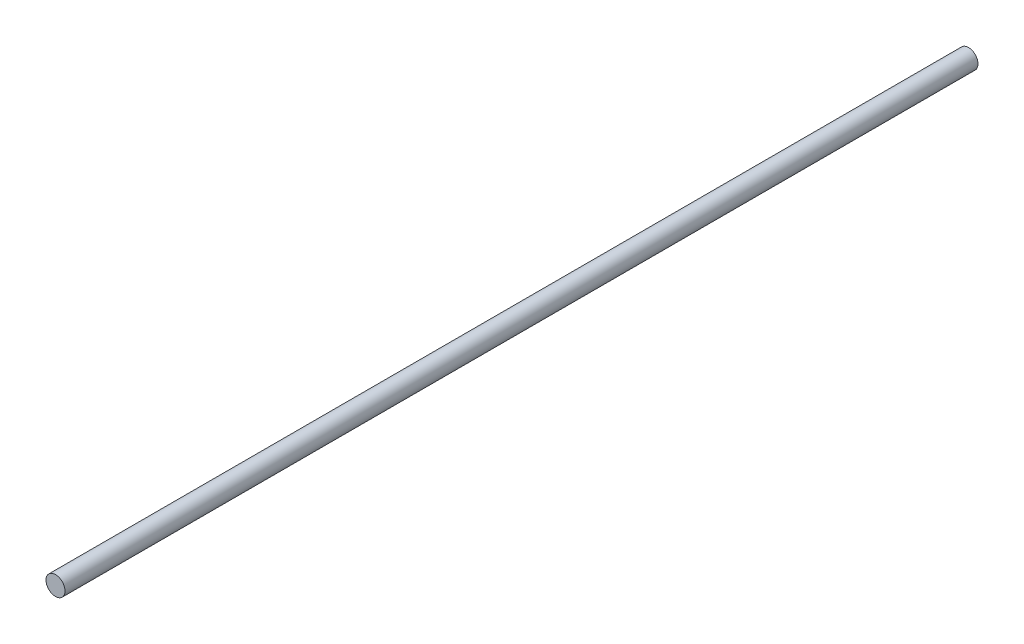
ISO-10303-21;
HEADER;
FILE_DESCRIPTION(('STEP AP214'),'2;1');
FILE_NAME('part.step','',(''),(''),'','','');
FILE_SCHEMA(('AUTOMOTIVE_DESIGN { 1 0 10303 214 1 1 1 1 }'));
ENDSEC;
DATA;
#1=APPLICATION_CONTEXT('core data for automotive mechanical design processes');
#2=APPLICATION_PROTOCOL_DEFINITION('international standard','automotive_design',2000,#1);
#3=PRODUCT_CONTEXT('',#1,'mechanical');
#4=PRODUCT('Part','Part','',(#3));
#5=PRODUCT_RELATED_PRODUCT_CATEGORY('part','',(#4));
#6=PRODUCT_DEFINITION_FORMATION('','',#4);
#7=PRODUCT_DEFINITION_CONTEXT('part definition',#1,'design');
#8=PRODUCT_DEFINITION('design','',#6,#7);
#9=PRODUCT_DEFINITION_SHAPE('','',#8);
#10=(LENGTH_UNIT() NAMED_UNIT(*) SI_UNIT(.MILLI.,.METRE.));
#11=(NAMED_UNIT(*) PLANE_ANGLE_UNIT() SI_UNIT($,.RADIAN.));
#12=(NAMED_UNIT(*) SI_UNIT($,.STERADIAN.) SOLID_ANGLE_UNIT());
#13=UNCERTAINTY_MEASURE_WITH_UNIT(LENGTH_MEASURE(1.E-05),#10,'distance_accuracy_value','');
#14=(GEOMETRIC_REPRESENTATION_CONTEXT(3) GLOBAL_UNCERTAINTY_ASSIGNED_CONTEXT((#13)) GLOBAL_UNIT_ASSIGNED_CONTEXT((#10,
#11,#12)) REPRESENTATION_CONTEXT('',''));
#15=CARTESIAN_POINT('',(0.,0.,0.));
#16=DIRECTION('',(0.,0.,1.));
#17=DIRECTION('',(1.,0.,0.));
#18=AXIS2_PLACEMENT_3D('',#15,#16,#17);
#19=CARTESIAN_POINT('',(0.,0.,152.4));
#20=DIRECTION('',(0.,0.,-1.));
#21=DIRECTION('',(-1.,0.,0.));
#22=AXIS2_PLACEMENT_3D('',#19,#20,#21);
#23=CYLINDRICAL_SURFACE('',#22,1.5875);
#24=CARTESIAN_POINT('',(0.,0.,152.4));
#25=DIRECTION('',(0.,0.,1.));
#26=DIRECTION('',(1.,0.,0.));
#27=AXIS2_PLACEMENT_3D('',#24,#25,#26);
#28=CIRCLE('',#27,1.5875);
#29=CARTESIAN_POINT('',(1.5875,0.,152.4));
#30=VERTEX_POINT('',#29);
#31=EDGE_CURVE('E10',#30,#30,#28,.T.);
#32=ORIENTED_EDGE('',*,*,#31,.F.);
#33=EDGE_LOOP('',(#32));
#34=FACE_BOUND('',#33,.T.);
#35=CARTESIAN_POINT('',(0.,0.,0.));
#36=DIRECTION('',(0.,0.,1.));
#37=DIRECTION('',(1.,0.,0.));
#38=AXIS2_PLACEMENT_3D('',#35,#36,#37);
#39=CIRCLE('',#38,1.5875);
#40=CARTESIAN_POINT('',(1.5875,0.,0.));
#41=VERTEX_POINT('',#40);
#42=EDGE_CURVE('E34',#41,#41,#39,.T.);
#43=ORIENTED_EDGE('',*,*,#42,.T.);
#44=EDGE_LOOP('',(#43));
#45=FACE_BOUND('',#44,.T.);
#46=ADVANCED_FACE('F31',(#34,#45),#23,.T.);
#47=CARTESIAN_POINT('',(0.,0.,152.4));
#48=DIRECTION('',(0.,0.,1.));
#49=DIRECTION('',(1.,0.,0.));
#50=AXIS2_PLACEMENT_3D('',#47,#48,#49);
#51=PLANE('',#50);
#52=ORIENTED_EDGE('',*,*,#31,.T.);
#53=EDGE_LOOP('',(#52));
#54=FACE_BOUND('',#53,.T.);
#55=ADVANCED_FACE('F46',(#54),#51,.T.);
#56=CARTESIAN_POINT('',(0.,0.,0.));
#57=DIRECTION('',(0.,0.,1.));
#58=DIRECTION('',(1.,0.,0.));
#59=AXIS2_PLACEMENT_3D('',#56,#57,#58);
#60=PLANE('',#59);
#61=ORIENTED_EDGE('',*,*,#42,.F.);
#62=EDGE_LOOP('',(#61));
#63=FACE_BOUND('',#62,.T.);
#64=ADVANCED_FACE('F44',(#63),#60,.F.);
#65=CLOSED_SHELL('',(#46,#55,#64));
#66=MANIFOLD_SOLID_BREP('B2',#65);
#67=ADVANCED_BREP_SHAPE_REPRESENTATION('',(#18,#66),#14);
#68=SHAPE_DEFINITION_REPRESENTATION(#9,#67);
ENDSEC;
END-ISO-10303-21;
